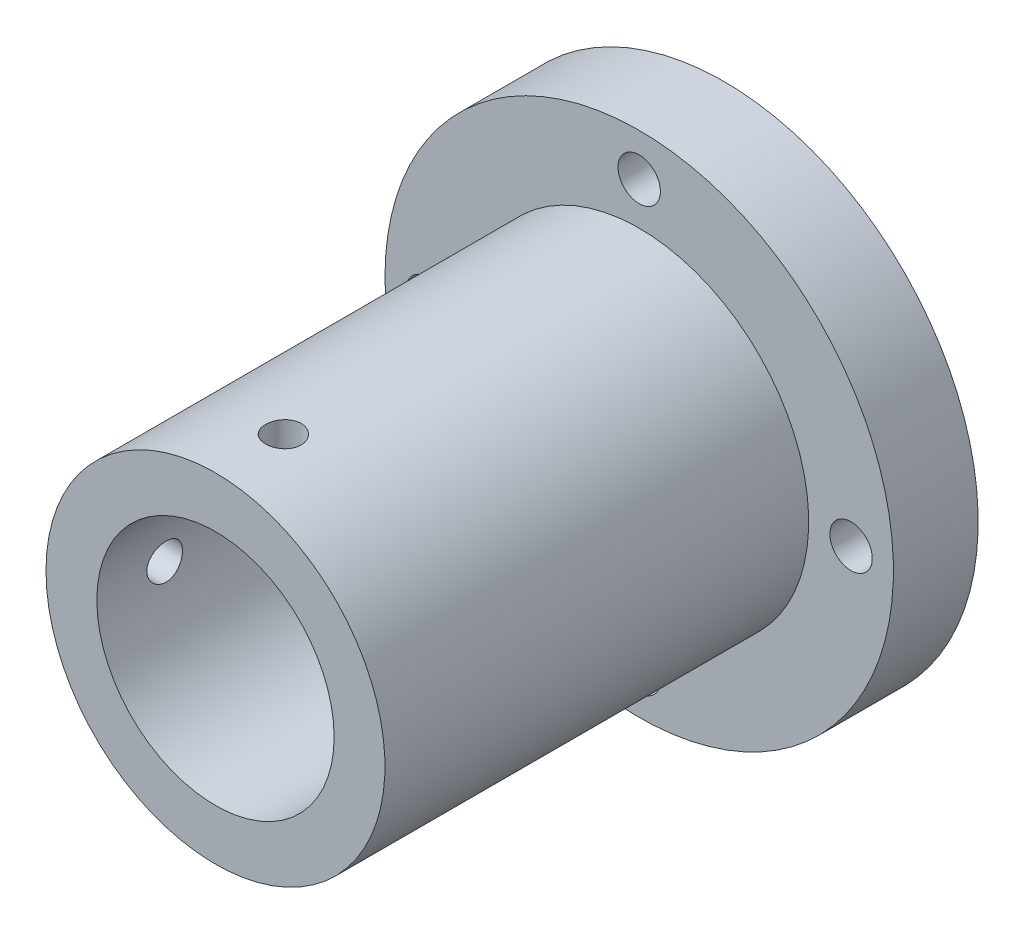
ISO-10303-21;
HEADER;
FILE_DESCRIPTION(('STEP AP214'),'2;1');
FILE_NAME('part.step','',(''),(''),'','','');
FILE_SCHEMA(('AUTOMOTIVE_DESIGN { 1 0 10303 214 1 1 1 1 }'));
ENDSEC;
DATA;
#1=APPLICATION_CONTEXT('core data for automotive mechanical design processes');
#2=APPLICATION_PROTOCOL_DEFINITION('international standard','automotive_design',2000,#1);
#3=PRODUCT_CONTEXT('',#1,'mechanical');
#4=PRODUCT('Part','Part','',(#3));
#5=PRODUCT_RELATED_PRODUCT_CATEGORY('part','',(#4));
#6=PRODUCT_DEFINITION_FORMATION('','',#4);
#7=PRODUCT_DEFINITION_CONTEXT('part definition',#1,'design');
#8=PRODUCT_DEFINITION('design','',#6,#7);
#9=PRODUCT_DEFINITION_SHAPE('','',#8);
#10=(LENGTH_UNIT() NAMED_UNIT(*) SI_UNIT(.MILLI.,.METRE.));
#11=(NAMED_UNIT(*) PLANE_ANGLE_UNIT() SI_UNIT($,.RADIAN.));
#12=(NAMED_UNIT(*) SI_UNIT($,.STERADIAN.) SOLID_ANGLE_UNIT());
#13=UNCERTAINTY_MEASURE_WITH_UNIT(LENGTH_MEASURE(1.E-05),#10,'distance_accuracy_value','');
#14=(GEOMETRIC_REPRESENTATION_CONTEXT(3) GLOBAL_UNCERTAINTY_ASSIGNED_CONTEXT((#13)) GLOBAL_UNIT_ASSIGNED_CONTEXT((#10,
#11,#12)) REPRESENTATION_CONTEXT('',''));
#15=CARTESIAN_POINT('',(0.,0.,0.));
#16=DIRECTION('',(0.,0.,1.));
#17=DIRECTION('',(1.,0.,0.));
#18=AXIS2_PLACEMENT_3D('',#15,#16,#17);
#19=CARTESIAN_POINT('',(0.,0.,5.));
#20=DIRECTION('',(0.,0.,1.));
#21=DIRECTION('',(1.,0.,0.));
#22=AXIS2_PLACEMENT_3D('',#19,#20,#21);
#23=PLANE('',#22);
#24=CARTESIAN_POINT('',(0.,0.,5.));
#25=DIRECTION('',(0.,0.,-1.));
#26=DIRECTION('',(-1.,0.,0.));
#27=AXIS2_PLACEMENT_3D('',#24,#25,#26);
#28=CIRCLE('',#27,14.);
#29=CARTESIAN_POINT('',(-14.,0.,5.));
#30=VERTEX_POINT('',#29);
#31=EDGE_CURVE('E17',#30,#30,#28,.F.);
#32=ORIENTED_EDGE('',*,*,#31,.T.);
#33=EDGE_LOOP('',(#32));
#34=FACE_BOUND('',#33,.T.);
#35=ADVANCED_FACE('F14',(#34),#23,.T.);
#36=CARTESIAN_POINT('',(0.,0.,-5.));
#37=DIRECTION('',(0.,0.,1.));
#38=DIRECTION('',(1.,0.,0.));
#39=AXIS2_PLACEMENT_3D('',#36,#37,#38);
#40=PLANE('',#39);
#41=CARTESIAN_POINT('',(-25.,0.,-5.));
#42=DIRECTION('',(0.,0.,-1.));
#43=DIRECTION('',(-1.,0.,0.));
#44=AXIS2_PLACEMENT_3D('',#41,#42,#43);
#45=CIRCLE('',#44,2.5);
#46=CARTESIAN_POINT('',(-27.5,0.,-5.));
#47=VERTEX_POINT('',#46);
#48=EDGE_CURVE('E70',#47,#47,#45,.F.);
#49=ORIENTED_EDGE('',*,*,#48,.T.);
#50=EDGE_LOOP('',(#49));
#51=FACE_BOUND('',#50,.T.);
#52=CARTESIAN_POINT('',(0.,-25.,-5.));
#53=DIRECTION('',(0.,0.,-1.));
#54=DIRECTION('',(-1.,0.,0.));
#55=AXIS2_PLACEMENT_3D('',#52,#53,#54);
#56=CIRCLE('',#55,2.5);
#57=CARTESIAN_POINT('',(-2.5,-25.,-5.));
#58=VERTEX_POINT('',#57);
#59=EDGE_CURVE('E115',#58,#58,#56,.F.);
#60=ORIENTED_EDGE('',*,*,#59,.T.);
#61=EDGE_LOOP('',(#60));
#62=FACE_BOUND('',#61,.T.);
#63=CARTESIAN_POINT('',(25.,0.,-5.));
#64=DIRECTION('',(0.,0.,-1.));
#65=DIRECTION('',(-1.,0.,0.));
#66=AXIS2_PLACEMENT_3D('',#63,#64,#65);
#67=CIRCLE('',#66,2.5);
#68=CARTESIAN_POINT('',(22.5,0.,-5.));
#69=VERTEX_POINT('',#68);
#70=EDGE_CURVE('E117',#69,#69,#67,.F.);
#71=ORIENTED_EDGE('',*,*,#70,.T.);
#72=EDGE_LOOP('',(#71));
#73=FACE_BOUND('',#72,.T.);
#74=CARTESIAN_POINT('',(0.,25.,-5.));
#75=DIRECTION('',(0.,0.,-1.));
#76=DIRECTION('',(-1.,0.,0.));
#77=AXIS2_PLACEMENT_3D('',#74,#75,#76);
#78=CIRCLE('',#77,2.5);
#79=CARTESIAN_POINT('',(-2.5,25.,-5.));
#80=VERTEX_POINT('',#79);
#81=EDGE_CURVE('E121',#80,#80,#78,.F.);
#82=ORIENTED_EDGE('',*,*,#81,.T.);
#83=EDGE_LOOP('',(#82));
#84=FACE_BOUND('',#83,.T.);
#85=CARTESIAN_POINT('',(0.,0.,-5.));
#86=DIRECTION('',(0.,0.,-1.));
#87=DIRECTION('',(-1.,0.,0.));
#88=AXIS2_PLACEMENT_3D('',#85,#86,#87);
#89=CIRCLE('',#88,30.);
#90=CARTESIAN_POINT('',(-30.,0.,-5.));
#91=VERTEX_POINT('',#90);
#92=EDGE_CURVE('E125',#91,#91,#89,.F.);
#93=ORIENTED_EDGE('',*,*,#92,.F.);
#94=EDGE_LOOP('',(#93));
#95=FACE_BOUND('',#94,.T.);
#96=ADVANCED_FACE('F78',(#51,#62,#73,#84,#95),#40,.F.);
#97=CARTESIAN_POINT('',(0.,0.,55.));
#98=DIRECTION('',(0.,0.,-1.));
#99=DIRECTION('',(-1.,0.,0.));
#100=AXIS2_PLACEMENT_3D('',#97,#98,#99);
#101=CYLINDRICAL_SURFACE('',#100,14.);
#102=CARTESIAN_POINT('',(-14.,0.,44.9));
#103=CARTESIAN_POINT('',(-13.9999980089787,-0.11714068290046,44.9000052949577));
#104=CARTESIAN_POINT('',(-13.9985131616946,-0.234432554313635,44.9098425976985));
#105=CARTESIAN_POINT('',(-13.9927290793554,-0.465823124922979,44.9489447616134));
#106=CARTESIAN_POINT('',(-13.9884240714138,-0.579914772594624,44.9782494744335));
#107=CARTESIAN_POINT('',(-13.9774834003008,-0.801395946791563,45.0553944225217));
#108=CARTESIAN_POINT('',(-13.9708504627315,-0.908793138939144,45.1032129880034));
#109=CARTESIAN_POINT('',(-13.9559885864224,-1.11399224510414,45.2159801319584));
#110=CARTESIAN_POINT('',(-13.9477602723685,-1.21179789229067,45.2809220091949));
#111=CARTESIAN_POINT('',(-13.9305486145,-1.39586278721887,45.4266462988982));
#112=CARTESIAN_POINT('',(-13.9215603333009,-1.48203529813868,45.5075377058939));
#113=CARTESIAN_POINT('',(-13.903880099461,-1.63964129329159,45.6826339614772));
#114=CARTESIAN_POINT('',(-13.8951881790357,-1.7110731794042,45.7768402517484));
#115=CARTESIAN_POINT('',(-13.8790382487596,-1.83749647372575,45.9764613403998));
#116=CARTESIAN_POINT('',(-13.8715865026312,-1.89240549328898,46.0819288677118));
#117=CARTESIAN_POINT('',(-13.8588269118523,-1.98369717270832,46.3007189372171));
#118=CARTESIAN_POINT('',(-13.8535189317151,-2.02008100340123,46.4140409824715));
#119=CARTESIAN_POINT('',(-13.8456955904233,-2.07302475948877,46.6444251605589));
#120=CARTESIAN_POINT('',(-13.8431596246646,-2.08973102294381,46.7614529514826));
#121=CARTESIAN_POINT('',(-13.8411048848352,-2.10329874143227,46.9966764318114));
#122=CARTESIAN_POINT('',(-13.8415859426359,-2.10016130228897,47.1148720557706));
#123=CARTESIAN_POINT('',(-13.8454920486523,-2.07425032244071,47.3480410205427));
#124=CARTESIAN_POINT('',(-13.8488926337376,-2.05163994330079,47.4630329616185));
#125=CARTESIAN_POINT('',(-13.8582164634308,-1.98767998650566,47.6875731850522));
#126=CARTESIAN_POINT('',(-13.8641398007478,-1.94632972017111,47.7971212671874));
#127=CARTESIAN_POINT('',(-13.8778689694365,-1.84589249546703,48.008162889936));
#128=CARTESIAN_POINT('',(-13.885682173365,-1.7867358461108,48.1096227643327));
#129=CARTESIAN_POINT('',(-13.9023046022562,-1.65241971553671,48.3012295792933));
#130=CARTESIAN_POINT('',(-13.9111138141088,-1.57726044494175,48.3913766687286));
#131=CARTESIAN_POINT('',(-13.928842633905,-1.41219190309235,48.5587379020603));
#132=CARTESIAN_POINT('',(-13.9377624766459,-1.32214507728795,48.6358163985924));
#133=CARTESIAN_POINT('',(-13.9546314946434,-1.13027383766345,48.7738230933106));
#134=CARTESIAN_POINT('',(-13.9625802305765,-1.02844413359441,48.8347439963716));
#135=CARTESIAN_POINT('',(-13.9766204724004,-0.815753279214099,48.9387074681598));
#136=CARTESIAN_POINT('',(-13.9827093630814,-0.704879686752521,48.9817248925358));
#137=CARTESIAN_POINT('',(-13.9923140680542,-0.477517996909949,49.0484036269948));
#138=CARTESIAN_POINT('',(-13.9958353148451,-0.361042312397396,49.0721058159094));
#139=CARTESIAN_POINT('',(-13.9985854781466,-0.203118908978934,49.0905516300589));
#140=CARTESIAN_POINT('',(-13.9991148171203,-0.162582918286002,49.0940919919781));
#141=CARTESIAN_POINT('',(-13.9998224239945,-0.0813707005441796,49.0988170974084));
#142=CARTESIAN_POINT('',(-14.0000006916774,-0.0406944734083723,49.1000018394593));
#143=CARTESIAN_POINT('',(-13.9999980089787,0.117140682900444,49.0999947050423));
#144=CARTESIAN_POINT('',(-13.9985131616946,0.234432554313618,49.0901574023015));
#145=CARTESIAN_POINT('',(-13.9927290793554,0.465823124922963,49.0510552383866));
#146=CARTESIAN_POINT('',(-13.9884240714138,0.579914772594608,49.0217505255665));
#147=CARTESIAN_POINT('',(-13.9774834003008,0.80139594679155,48.9446055774783));
#148=CARTESIAN_POINT('',(-13.9708504627315,0.908793138939133,48.8967870119966));
#149=CARTESIAN_POINT('',(-13.9559885864224,1.11399224510413,48.7840198680416));
#150=CARTESIAN_POINT('',(-13.9477602723685,1.21179789229066,48.7190779908051));
#151=CARTESIAN_POINT('',(-13.9305486145,1.39586278721886,48.5733537011018));
#152=CARTESIAN_POINT('',(-13.9215603333009,1.48203529813867,48.4924622941061));
#153=CARTESIAN_POINT('',(-13.903880099461,1.63964129329158,48.3173660385228));
#154=CARTESIAN_POINT('',(-13.8951881790357,1.71107317940419,48.2231597482516));
#155=CARTESIAN_POINT('',(-13.8790382487596,1.83749647372574,48.0235386596002));
#156=CARTESIAN_POINT('',(-13.8715865026312,1.89240549328898,47.9180711322883));
#157=CARTESIAN_POINT('',(-13.8588269118523,1.98369717270831,47.6992810627829));
#158=CARTESIAN_POINT('',(-13.8535189317151,2.02008100340122,47.5859590175285));
#159=CARTESIAN_POINT('',(-13.8456955904233,2.07302475948877,47.3555748394411));
#160=CARTESIAN_POINT('',(-13.8431596246646,2.08973102294381,47.2385470485175));
#161=CARTESIAN_POINT('',(-13.8411048848352,2.10329874143227,47.0033235681886));
#162=CARTESIAN_POINT('',(-13.8415859426359,2.10016130228897,46.8851279442294));
#163=CARTESIAN_POINT('',(-13.8454920486523,2.07425032244071,46.6519589794574));
#164=CARTESIAN_POINT('',(-13.8488926337376,2.05163994330079,46.5369670383815));
#165=CARTESIAN_POINT('',(-13.8582164634308,1.98767998650567,46.3124268149478));
#166=CARTESIAN_POINT('',(-13.8641398007478,1.94632972017112,46.2028787328126));
#167=CARTESIAN_POINT('',(-13.8778689694365,1.84589249546704,45.991837110064));
#168=CARTESIAN_POINT('',(-13.885682173365,1.78673584611081,45.8903772356673));
#169=CARTESIAN_POINT('',(-13.9023046022562,1.65241971553672,45.6987704207067));
#170=CARTESIAN_POINT('',(-13.9111138141088,1.57726044494176,45.6086233312714));
#171=CARTESIAN_POINT('',(-13.928842633905,1.41219190309236,45.4412620979398));
#172=CARTESIAN_POINT('',(-13.9377624766459,1.32214507728797,45.3641836014077));
#173=CARTESIAN_POINT('',(-13.9546314946434,1.13027383766346,45.2261769066894));
#174=CARTESIAN_POINT('',(-13.9625802305765,1.02844413359443,45.1652560036284));
#175=CARTESIAN_POINT('',(-13.9766204724004,0.815753279214116,45.0612925318403));
#176=CARTESIAN_POINT('',(-13.9827093630814,0.704879686752538,45.0182751074642));
#177=CARTESIAN_POINT('',(-13.9923140680542,0.477517996909965,44.9515963730052));
#178=CARTESIAN_POINT('',(-13.9958353148451,0.36104231239741,44.9278941840906));
#179=CARTESIAN_POINT('',(-13.9985854781466,0.203118908978943,44.9094483699411));
#180=CARTESIAN_POINT('',(-13.9991148171203,0.162582918286006,44.9059080080219));
#181=CARTESIAN_POINT('',(-13.9998224239945,0.0813707005441739,44.9011829025916));
#182=CARTESIAN_POINT('',(-14.0000006916774,0.0406944734083618,44.8999981605407));
#183=CARTESIAN_POINT('',(-14.,0.,44.9));
#184=B_SPLINE_CURVE_WITH_KNOTS('',3,(#102,#103,#104,#105,#106,#107,#108,#109,#110,#111,#112,
#113,#114,#115,#116,#117,#118,#119,#120,#121,#122,#123,#124,#125,#126,#127,#128,#129,#130,#131,
#132,#133,#134,#135,#136,#137,#138,#139,#140,#141,#142,#143,#144,#145,#146,#147,#148,#149,#150,
#151,#152,#153,#154,#155,#156,#157,#158,#159,#160,#161,#162,#163,#164,#165,#166,#167,#168,#169,
#170,#171,#172,#173,#174,#175,#176,#177,#178,#179,#180,#181,#182,#183),.UNSPECIFIED.,.T.,.F.,(4,
2,2,2,2,2,2,2,2,2,2,2,2,2,2,2,2,2,2,2,2,2,2,2,2,2,2,2,2,2,2,2,2,2,2,2,2,2,2,2,4),(0.,
0.351266823688869,0.703254949111487,1.05483232478804,1.40627231376208,1.76020282599753,
2.11417168984904,2.469877380567,2.82556058703228,3.17858160540013,3.53158295125868,
3.8816549994281,4.23173991357371,4.58321321765074,4.93468189600086,5.28960086702804,
5.64467981160442,6.00025577380755,6.35507722496767,6.47710664464262,6.59913613996315,
6.95040296365201,7.30239108907463,7.65396846475119,8.00540845372523,8.35933896596067,
8.71330782981218,9.06901352053015,9.42469672699542,9.77771774536328,10.1307190912218,
10.4807911393912,10.8308760535368,11.1823493576139,11.533818035964,11.8887370069912,
12.2438159515676,12.5993919137707,12.9542133649308,13.0762427846058,13.1982722799263),.UNSPECIFIED.);
#185=CARTESIAN_POINT('',(-14.,0.,44.9));
#186=VERTEX_POINT('',#185);
#187=EDGE_CURVE('E82',#186,#186,#184,.T.);
#188=ORIENTED_EDGE('',*,*,#187,.T.);
#189=EDGE_LOOP('',(#188));
#190=FACE_BOUND('',#189,.T.);
#191=ORIENTED_EDGE('',*,*,#31,.F.);
#192=EDGE_LOOP('',(#191));
#193=FACE_BOUND('',#192,.T.);
#194=CARTESIAN_POINT('',(0.,0.,55.));
#195=DIRECTION('',(0.,0.,-1.));
#196=DIRECTION('',(-1.,0.,0.));
#197=AXIS2_PLACEMENT_3D('',#194,#195,#196);
#198=CIRCLE('',#197,14.);
#199=CARTESIAN_POINT('',(-14.,0.,55.));
#200=VERTEX_POINT('',#199);
#201=EDGE_CURVE('E69',#200,#200,#198,.T.);
#202=ORIENTED_EDGE('',*,*,#201,.F.);
#203=EDGE_LOOP('',(#202));
#204=FACE_BOUND('',#203,.T.);
#205=CARTESIAN_POINT('',(0.,14.,49.1));
#206=CARTESIAN_POINT('',(0.117140682900458,13.9999980089787,49.0999947050423));
#207=CARTESIAN_POINT('',(0.234432554313634,13.9985131616946,49.0901574023015));
#208=CARTESIAN_POINT('',(0.465823124922978,13.9927290793554,49.0510552383866));
#209=CARTESIAN_POINT('',(0.579914772594622,13.9884240714138,49.0217505255665));
#210=CARTESIAN_POINT('',(0.801395946791563,13.9774834003008,48.9446055774783));
#211=CARTESIAN_POINT('',(0.908793138939148,13.9708504627315,48.8967870119966));
#212=CARTESIAN_POINT('',(1.11399224510415,13.9559885864224,48.7840198680416));
#213=CARTESIAN_POINT('',(1.21179789229067,13.9477602723685,48.7190779908051));
#214=CARTESIAN_POINT('',(1.39586278721887,13.9305486145,48.5733537011018));
#215=CARTESIAN_POINT('',(1.48203529813868,13.9215603333009,48.4924622941061));
#216=CARTESIAN_POINT('',(1.63964129329159,13.903880099461,48.3173660385228));
#217=CARTESIAN_POINT('',(1.7110731794042,13.8951881790357,48.2231597482516));
#218=CARTESIAN_POINT('',(1.83749647372575,13.8790382487596,48.0235386596002));
#219=CARTESIAN_POINT('',(1.89240549328899,13.8715865026312,47.9180711322882));
#220=CARTESIAN_POINT('',(1.98369717270832,13.8588269118523,47.6992810627829));
#221=CARTESIAN_POINT('',(2.02008100340123,13.8535189317151,47.5859590175285));
#222=CARTESIAN_POINT('',(2.07302475948877,13.8456955904233,47.3555748394411));
#223=CARTESIAN_POINT('',(2.08973102294381,13.8431596246646,47.2385470485174));
#224=CARTESIAN_POINT('',(2.10329874143227,13.8411048848352,47.0033235681886));
#225=CARTESIAN_POINT('',(2.10016130228897,13.8415859426359,46.8851279442294));
#226=CARTESIAN_POINT('',(2.07425032244071,13.8454920486523,46.6519589794573));
#227=CARTESIAN_POINT('',(2.05163994330079,13.8488926337376,46.5369670383815));
#228=CARTESIAN_POINT('',(1.98767998650566,13.8582164634308,46.3124268149478));
#229=CARTESIAN_POINT('',(1.94632972017111,13.8641398007478,46.2028787328126));
#230=CARTESIAN_POINT('',(1.84589249546703,13.8778689694365,45.991837110064));
#231=CARTESIAN_POINT('',(1.78673584611081,13.885682173365,45.8903772356673));
#232=CARTESIAN_POINT('',(1.65241971553671,13.9023046022562,45.6987704207067));
#233=CARTESIAN_POINT('',(1.57726044494176,13.9111138141088,45.6086233312714));
#234=CARTESIAN_POINT('',(1.41219190309235,13.928842633905,45.4412620979398));
#235=CARTESIAN_POINT('',(1.32214507728796,13.9377624766459,45.3641836014076));
#236=CARTESIAN_POINT('',(1.13027383766346,13.9546314946434,45.2261769066894));
#237=CARTESIAN_POINT('',(1.02844413359442,13.9625802305765,45.1652560036284));
#238=CARTESIAN_POINT('',(0.815753279214103,13.9766204724004,45.0612925318403));
#239=CARTESIAN_POINT('',(0.704879686752525,13.9827093630814,45.0182751074642));
#240=CARTESIAN_POINT('',(0.477517996909952,13.9923140680542,44.9515963730052));
#241=CARTESIAN_POINT('',(0.361042312397397,13.9958353148451,44.9278941840906));
#242=CARTESIAN_POINT('',(0.203118908978932,13.9985854781466,44.9094483699411));
#243=CARTESIAN_POINT('',(0.162582918285998,13.9991148171203,44.9059080080219));
#244=CARTESIAN_POINT('',(0.0813707005441706,13.9998224239945,44.9011829025916));
#245=CARTESIAN_POINT('',(0.0406944734083609,14.0000006916774,44.8999981605407));
#246=CARTESIAN_POINT('',(-0.117140682900458,13.9999980089787,44.9000052949577));
#247=CARTESIAN_POINT('',(-0.234432554313633,13.9985131616946,44.9098425976985));
#248=CARTESIAN_POINT('',(-0.465823124922977,13.9927290793554,44.9489447616134));
#249=CARTESIAN_POINT('',(-0.579914772594622,13.9884240714138,44.9782494744335));
#250=CARTESIAN_POINT('',(-0.801395946791564,13.9774834003008,45.0553944225217));
#251=CARTESIAN_POINT('',(-0.908793138939148,13.9708504627315,45.1032129880034));
#252=CARTESIAN_POINT('',(-1.11399224510415,13.9559885864224,45.2159801319584));
#253=CARTESIAN_POINT('',(-1.21179789229067,13.9477602723685,45.2809220091949));
#254=CARTESIAN_POINT('',(-1.39586278721887,13.9305486145,45.4266462988982));
#255=CARTESIAN_POINT('',(-1.48203529813868,13.9215603333009,45.5075377058939));
#256=CARTESIAN_POINT('',(-1.63964129329159,13.903880099461,45.6826339614772));
#257=CARTESIAN_POINT('',(-1.7110731794042,13.8951881790357,45.7768402517484));
#258=CARTESIAN_POINT('',(-1.83749647372575,13.8790382487596,45.9764613403998));
#259=CARTESIAN_POINT('',(-1.89240549328899,13.8715865026312,46.0819288677118));
#260=CARTESIAN_POINT('',(-1.98369717270832,13.8588269118523,46.3007189372171));
#261=CARTESIAN_POINT('',(-2.02008100340123,13.8535189317151,46.4140409824715));
#262=CARTESIAN_POINT('',(-2.07302475948877,13.8456955904233,46.6444251605589));
#263=CARTESIAN_POINT('',(-2.08973102294382,13.8431596246646,46.7614529514826));
#264=CARTESIAN_POINT('',(-2.10329874143227,13.8411048848352,46.9966764318114));
#265=CARTESIAN_POINT('',(-2.10016130228897,13.8415859426359,47.1148720557706));
#266=CARTESIAN_POINT('',(-2.07425032244071,13.8454920486523,47.3480410205427));
#267=CARTESIAN_POINT('',(-2.05163994330079,13.8488926337376,47.4630329616185));
#268=CARTESIAN_POINT('',(-1.98767998650566,13.8582164634308,47.6875731850522));
#269=CARTESIAN_POINT('',(-1.94632972017111,13.8641398007478,47.7971212671874));
#270=CARTESIAN_POINT('',(-1.84589249546703,13.8778689694365,48.008162889936));
#271=CARTESIAN_POINT('',(-1.78673584611081,13.885682173365,48.1096227643327));
#272=CARTESIAN_POINT('',(-1.65241971553671,13.9023046022562,48.3012295792933));
#273=CARTESIAN_POINT('',(-1.57726044494176,13.9111138141088,48.3913766687286));
#274=CARTESIAN_POINT('',(-1.41219190309235,13.928842633905,48.5587379020602));
#275=CARTESIAN_POINT('',(-1.32214507728796,13.9377624766459,48.6358163985924));
#276=CARTESIAN_POINT('',(-1.13027383766345,13.9546314946434,48.7738230933106));
#277=CARTESIAN_POINT('',(-1.02844413359442,13.9625802305765,48.8347439963716));
#278=CARTESIAN_POINT('',(-0.815753279214103,13.9766204724004,48.9387074681597));
#279=CARTESIAN_POINT('',(-0.704879686752526,13.9827093630814,48.9817248925358));
#280=CARTESIAN_POINT('',(-0.477517996909952,13.9923140680542,49.0484036269948));
#281=CARTESIAN_POINT('',(-0.361042312397397,13.9958353148451,49.0721058159094));
#282=CARTESIAN_POINT('',(-0.203118908978932,13.9985854781466,49.0905516300589));
#283=CARTESIAN_POINT('',(-0.162582918285998,13.9991148171203,49.0940919919781));
#284=CARTESIAN_POINT('',(-0.0813707005441705,13.9998224239945,49.0988170974084));
#285=CARTESIAN_POINT('',(-0.0406944734083608,14.0000006916774,49.1000018394593));
#286=CARTESIAN_POINT('',(0.,14.,49.1));
#287=B_SPLINE_CURVE_WITH_KNOTS('',3,(#205,#206,#207,#208,#209,#210,#211,#212,#213,#214,#215,
#216,#217,#218,#219,#220,#221,#222,#223,#224,#225,#226,#227,#228,#229,#230,#231,#232,#233,#234,
#235,#236,#237,#238,#239,#240,#241,#242,#243,#244,#245,#246,#247,#248,#249,#250,#251,#252,#253,
#254,#255,#256,#257,#258,#259,#260,#261,#262,#263,#264,#265,#266,#267,#268,#269,#270,#271,#272,
#273,#274,#275,#276,#277,#278,#279,#280,#281,#282,#283,#284,#285,#286),.UNSPECIFIED.,.T.,.F.,(4,
2,2,2,2,2,2,2,2,2,2,2,2,2,2,2,2,2,2,2,2,2,2,2,2,2,2,2,2,2,2,2,2,2,2,2,2,2,2,2,4),(0.,
0.351266823688869,0.703254949111487,1.05483232478804,1.40627231376209,1.76020282599753,
2.11417168984904,2.46987738056701,2.82556058703228,3.17858160540014,3.53158295125869,
3.8816549994281,4.2317399135737,4.58321321765073,4.93468189600085,5.28960086702803,
5.64467981160441,6.00025577380755,6.35507722496767,6.47710664464262,6.59913613996316,
6.95040296365203,7.30239108907465,7.6539684647512,8.00540845372525,8.35933896596069,
8.7133078298122,9.06901352053017,9.42469672699544,9.77771774536331,10.1307190912218,
10.4807911393913,10.8308760535369,11.1823493576139,11.533818035964,11.8887370069912,
12.2438159515676,12.5993919137707,12.9542133649308,13.0762427846058,13.1982722799263),.UNSPECIFIED.);
#288=CARTESIAN_POINT('',(0.,14.,49.1));
#289=VERTEX_POINT('',#288);
#290=EDGE_CURVE('E62',#289,#289,#287,.T.);
#291=ORIENTED_EDGE('',*,*,#290,.T.);
#292=EDGE_LOOP('',(#291));
#293=FACE_BOUND('',#292,.T.);
#294=ADVANCED_FACE('F73',(#190,#193,#204,#293),#101,.F.);
#295=CARTESIAN_POINT('',(0.,0.,5.));
#296=DIRECTION('',(0.,0.,-1.));
#297=DIRECTION('',(-1.,0.,0.));
#298=AXIS2_PLACEMENT_3D('',#295,#296,#297);
#299=CYLINDRICAL_SURFACE('',#298,30.);
#300=ORIENTED_EDGE('',*,*,#92,.T.);
#301=EDGE_LOOP('',(#300));
#302=FACE_BOUND('',#301,.T.);
#303=CARTESIAN_POINT('',(0.,0.,5.));
#304=DIRECTION('',(0.,0.,-1.));
#305=DIRECTION('',(-1.,0.,0.));
#306=AXIS2_PLACEMENT_3D('',#303,#304,#305);
#307=CIRCLE('',#306,30.);
#308=CARTESIAN_POINT('',(-30.,0.,5.));
#309=VERTEX_POINT('',#308);
#310=EDGE_CURVE('E87',#309,#309,#307,.F.);
#311=ORIENTED_EDGE('',*,*,#310,.F.);
#312=EDGE_LOOP('',(#311));
#313=FACE_BOUND('',#312,.T.);
#314=ADVANCED_FACE('F77',(#302,#313),#299,.T.);
#315=CARTESIAN_POINT('',(0.,25.,-5.));
#316=DIRECTION('',(0.,0.,-1.));
#317=DIRECTION('',(-1.,0.,0.));
#318=AXIS2_PLACEMENT_3D('',#315,#316,#317);
#319=CYLINDRICAL_SURFACE('',#318,2.5);
#320=ORIENTED_EDGE('',*,*,#81,.F.);
#321=EDGE_LOOP('',(#320));
#322=FACE_BOUND('',#321,.T.);
#323=CARTESIAN_POINT('',(0.,25.,5.));
#324=DIRECTION('',(0.,0.,-1.));
#325=DIRECTION('',(-1.,0.,0.));
#326=AXIS2_PLACEMENT_3D('',#323,#324,#325);
#327=CIRCLE('',#326,2.5);
#328=CARTESIAN_POINT('',(-2.5,25.,5.));
#329=VERTEX_POINT('',#328);
#330=EDGE_CURVE('E90',#329,#329,#327,.T.);
#331=ORIENTED_EDGE('',*,*,#330,.F.);
#332=EDGE_LOOP('',(#331));
#333=FACE_BOUND('',#332,.T.);
#334=ADVANCED_FACE('F205',(#322,#333),#319,.F.);
#335=CARTESIAN_POINT('',(25.,0.,-5.));
#336=DIRECTION('',(0.,0.,-1.));
#337=DIRECTION('',(-1.,0.,0.));
#338=AXIS2_PLACEMENT_3D('',#335,#336,#337);
#339=CYLINDRICAL_SURFACE('',#338,2.5);
#340=ORIENTED_EDGE('',*,*,#70,.F.);
#341=EDGE_LOOP('',(#340));
#342=FACE_BOUND('',#341,.T.);
#343=CARTESIAN_POINT('',(25.,0.,5.));
#344=DIRECTION('',(0.,0.,-1.));
#345=DIRECTION('',(-1.,0.,0.));
#346=AXIS2_PLACEMENT_3D('',#343,#344,#345);
#347=CIRCLE('',#346,2.5);
#348=CARTESIAN_POINT('',(22.5,0.,5.));
#349=VERTEX_POINT('',#348);
#350=EDGE_CURVE('E93',#349,#349,#347,.T.);
#351=ORIENTED_EDGE('',*,*,#350,.F.);
#352=EDGE_LOOP('',(#351));
#353=FACE_BOUND('',#352,.T.);
#354=ADVANCED_FACE('F110',(#342,#353),#339,.F.);
#355=CARTESIAN_POINT('',(0.,-25.,-5.));
#356=DIRECTION('',(0.,0.,-1.));
#357=DIRECTION('',(-1.,0.,0.));
#358=AXIS2_PLACEMENT_3D('',#355,#356,#357);
#359=CYLINDRICAL_SURFACE('',#358,2.5);
#360=ORIENTED_EDGE('',*,*,#59,.F.);
#361=EDGE_LOOP('',(#360));
#362=FACE_BOUND('',#361,.T.);
#363=CARTESIAN_POINT('',(0.,-25.,5.));
#364=DIRECTION('',(0.,0.,-1.));
#365=DIRECTION('',(-1.,0.,0.));
#366=AXIS2_PLACEMENT_3D('',#363,#364,#365);
#367=CIRCLE('',#366,2.5);
#368=CARTESIAN_POINT('',(-2.5,-25.,5.));
#369=VERTEX_POINT('',#368);
#370=EDGE_CURVE('E95',#369,#369,#367,.T.);
#371=ORIENTED_EDGE('',*,*,#370,.F.);
#372=EDGE_LOOP('',(#371));
#373=FACE_BOUND('',#372,.T.);
#374=ADVANCED_FACE('F104',(#362,#373),#359,.F.);
#375=CARTESIAN_POINT('',(-25.,0.,-5.));
#376=DIRECTION('',(0.,0.,-1.));
#377=DIRECTION('',(-1.,0.,0.));
#378=AXIS2_PLACEMENT_3D('',#375,#376,#377);
#379=CYLINDRICAL_SURFACE('',#378,2.5);
#380=ORIENTED_EDGE('',*,*,#48,.F.);
#381=EDGE_LOOP('',(#380));
#382=FACE_BOUND('',#381,.T.);
#383=CARTESIAN_POINT('',(-25.,0.,5.));
#384=DIRECTION('',(0.,0.,-1.));
#385=DIRECTION('',(-1.,0.,0.));
#386=AXIS2_PLACEMENT_3D('',#383,#384,#385);
#387=CIRCLE('',#386,2.5);
#388=CARTESIAN_POINT('',(-27.5,0.,5.));
#389=VERTEX_POINT('',#388);
#390=EDGE_CURVE('E50',#389,#389,#387,.T.);
#391=ORIENTED_EDGE('',*,*,#390,.F.);
#392=EDGE_LOOP('',(#391));
#393=FACE_BOUND('',#392,.T.);
#394=ADVANCED_FACE('F57',(#382,#393),#379,.F.);
#395=CARTESIAN_POINT('',(0.,0.,47.));
#396=DIRECTION('',(0.,-1.,0.));
#397=DIRECTION('',(0.,0.,-1.));
#398=AXIS2_PLACEMENT_3D('',#395,#396,#397);
#399=CYLINDRICAL_SURFACE('',#398,2.1);
#400=ORIENTED_EDGE('',*,*,#290,.F.);
#401=EDGE_LOOP('',(#400));
#402=FACE_BOUND('',#401,.T.);
#403=CARTESIAN_POINT('',(0.,20.,44.9));
#404=CARTESIAN_POINT('',(0.117505845996309,19.9999986301854,44.9000050834901));
#405=CARTESIAN_POINT('',(0.235167108011225,19.998952658043,44.9099033769067));
#406=CARTESIAN_POINT('',(0.467305004892584,19.9948785306546,44.9492593784143));
#407=CARTESIAN_POINT('',(0.581774434833952,19.991846218339,44.9787581087213));
#408=CARTESIAN_POINT('',(0.804015461737195,19.9841414039624,45.0564485302324));
#409=CARTESIAN_POINT('',(0.911793636954229,19.9794705438234,45.1046215137847));
#410=CARTESIAN_POINT('',(1.11768293146098,19.9690115905968,45.2182566692385));
#411=CARTESIAN_POINT('',(1.21579820729022,19.9632239810824,45.2837113623418));
#412=CARTESIAN_POINT('',(1.40002924042998,19.9511524636972,45.4303417523556));
#413=CARTESIAN_POINT('',(1.48610042496362,19.9448668404772,45.5115733201196));
#414=CARTESIAN_POINT('',(1.64341864167484,19.9325216200648,45.6873357474427));
#415=CARTESIAN_POINT('',(1.71466424971689,19.9264620446322,45.7818678831855));
#416=CARTESIAN_POINT('',(1.84045789861986,19.9152385541419,45.9818167137933));
#417=CARTESIAN_POINT('',(1.89496671332757,19.9100767552911,46.0872582160187));
#418=CARTESIAN_POINT('',(1.9854883044464,19.9012541552669,46.3058600661494));
#419=CARTESIAN_POINT('',(2.0215017433712,19.8975933003298,46.4190201374072));
#420=CARTESIAN_POINT('',(2.07388177312296,19.8922022986457,46.6494037546083));
#421=CARTESIAN_POINT('',(2.09032057514461,19.8904650573267,46.7666107137822));
#422=CARTESIAN_POINT('',(2.10330794059689,19.8890960249878,47.0021321306547));
#423=CARTESIAN_POINT('',(2.09985704207379,19.8894641770139,47.1204465583081));
#424=CARTESIAN_POINT('',(2.07322249630994,19.8922578471505,47.3543243165241));
#425=CARTESIAN_POINT('',(2.05011800082258,19.8946751126459,47.4698967735539));
#426=CARTESIAN_POINT('',(1.9849549698465,19.9012817942794,47.6955156519012));
#427=CARTESIAN_POINT('',(1.94289598328955,19.9054712525911,47.8055619416408));
#428=CARTESIAN_POINT('',(1.84092926233362,19.915159913536,48.0172563619201));
#429=CARTESIAN_POINT('',(1.78098593709443,19.9206617234034,48.1188872251712));
#430=CARTESIAN_POINT('',(1.64498296264359,19.9323524301279,48.3106676925109));
#431=CARTESIAN_POINT('',(1.56892411973582,19.9385412926024,48.4008178706488));
#432=CARTESIAN_POINT('',(1.40242305071538,19.9509447407233,48.5675312161979));
#433=CARTESIAN_POINT('',(1.31191526463758,19.9571593114111,48.6440289151933));
#434=CARTESIAN_POINT('',(1.11925847652789,19.968889757131,48.7807914070323));
#435=CARTESIAN_POINT('',(1.01710412339278,19.974405308516,48.8410486949767));
#436=CARTESIAN_POINT('',(0.803981331332801,19.9841187855564,48.943610840698));
#437=CARTESIAN_POINT('',(0.693004007948912,19.9883153614376,48.9858973235211));
#438=CARTESIAN_POINT('',(0.46562180827283,19.9949009482533,49.0511296000127));
#439=CARTESIAN_POINT('',(0.349228997392624,19.9972937906352,49.0741164014978));
#440=CARTESIAN_POINT('',(0.193380161984669,19.9991025766579,49.0914376869322));
#441=CARTESIAN_POINT('',(0.154779255038439,19.999438440425,49.0946461831563));
#442=CARTESIAN_POINT('',(0.0774578621785602,19.9998873779111,49.0989281778616));
#443=CARTESIAN_POINT('',(0.0387373762367906,20.0000004515777,49.1000016758406));
#444=CARTESIAN_POINT('',(-0.117505845996308,19.9999986301854,49.0999949165099));
#445=CARTESIAN_POINT('',(-0.235167108011224,19.998952658043,49.0900966230933));
#446=CARTESIAN_POINT('',(-0.467305004892583,19.9948785306546,49.0507406215857));
#447=CARTESIAN_POINT('',(-0.581774434833952,19.991846218339,49.0212418912787));
#448=CARTESIAN_POINT('',(-0.804015461737196,19.9841414039624,48.9435514697676));
#449=CARTESIAN_POINT('',(-0.91179363695423,19.9794705438234,48.8953784862153));
#450=CARTESIAN_POINT('',(-1.11768293146098,19.9690115905968,48.7817433307615));
#451=CARTESIAN_POINT('',(-1.21579820729022,19.9632239810824,48.7162886376582));
#452=CARTESIAN_POINT('',(-1.40002924042998,19.9511524636972,48.5696582476444));
#453=CARTESIAN_POINT('',(-1.48610042496362,19.9448668404772,48.4884266798804));
#454=CARTESIAN_POINT('',(-1.64341864167484,19.9325216200648,48.3126642525573));
#455=CARTESIAN_POINT('',(-1.71466424971689,19.9264620446322,48.2181321168145));
#456=CARTESIAN_POINT('',(-1.84045789861986,19.9152385541419,48.0181832862067));
#457=CARTESIAN_POINT('',(-1.89496671332757,19.9100767552911,47.9127417839813));
#458=CARTESIAN_POINT('',(-1.9854883044464,19.9012541552669,47.6941399338506));
#459=CARTESIAN_POINT('',(-2.0215017433712,19.8975933003298,47.5809798625928));
#460=CARTESIAN_POINT('',(-2.07388177312296,19.8922022986457,47.3505962453917));
#461=CARTESIAN_POINT('',(-2.09032057514461,19.8904650573267,47.2333892862178));
#462=CARTESIAN_POINT('',(-2.10330794059689,19.8890960249878,46.9978678693453));
#463=CARTESIAN_POINT('',(-2.09985704207379,19.8894641770139,46.8795534416919));
#464=CARTESIAN_POINT('',(-2.07322249630994,19.8922578471505,46.6456756834759));
#465=CARTESIAN_POINT('',(-2.05011800082258,19.8946751126459,46.5301032264461));
#466=CARTESIAN_POINT('',(-1.9849549698465,19.9012817942794,46.3044843480988));
#467=CARTESIAN_POINT('',(-1.94289598328955,19.9054712525911,46.1944380583592));
#468=CARTESIAN_POINT('',(-1.84092926233362,19.915159913536,45.9827436380799));
#469=CARTESIAN_POINT('',(-1.78098593709443,19.9206617234034,45.8811127748288));
#470=CARTESIAN_POINT('',(-1.64498296264359,19.9323524301279,45.6893323074891));
#471=CARTESIAN_POINT('',(-1.56892411973583,19.9385412926024,45.5991821293512));
#472=CARTESIAN_POINT('',(-1.40242305071538,19.9509447407233,45.4324687838021));
#473=CARTESIAN_POINT('',(-1.31191526463759,19.9571593114111,45.3559710848067));
#474=CARTESIAN_POINT('',(-1.11925847652789,19.968889757131,45.2192085929677));
#475=CARTESIAN_POINT('',(-1.01710412339278,19.974405308516,45.1589513050233));
#476=CARTESIAN_POINT('',(-0.803981331332799,19.9841187855564,45.056389159302));
#477=CARTESIAN_POINT('',(-0.69300400794891,19.9883153614376,45.0141026764789));
#478=CARTESIAN_POINT('',(-0.465621808272827,19.9949009482533,44.9488703999873));
#479=CARTESIAN_POINT('',(-0.349228997392621,19.9972937906352,44.9258835985022));
#480=CARTESIAN_POINT('',(-0.193380161984668,19.9991025766579,44.9085623130678));
#481=CARTESIAN_POINT('',(-0.154779255038439,19.999438440425,44.9053538168437));
#482=CARTESIAN_POINT('',(-0.0774578621785597,19.9998873779111,44.9010718221384));
#483=CARTESIAN_POINT('',(-0.0387373762367903,20.0000004515777,44.8999983241594));
#484=CARTESIAN_POINT('',(0.,20.,44.9));
#485=B_SPLINE_CURVE_WITH_KNOTS('',3,(#403,#404,#405,#406,#407,#408,#409,#410,#411,#412,#413,
#414,#415,#416,#417,#418,#419,#420,#421,#422,#423,#424,#425,#426,#427,#428,#429,#430,#431,#432,
#433,#434,#435,#436,#437,#438,#439,#440,#441,#442,#443,#444,#445,#446,#447,#448,#449,#450,#451,
#452,#453,#454,#455,#456,#457,#458,#459,#460,#461,#462,#463,#464,#465,#466,#467,#468,#469,#470,
#471,#472,#473,#474,#475,#476,#477,#478,#479,#480,#481,#482,#483,#484),.UNSPECIFIED.,.T.,.F.,(4,
2,2,2,2,2,2,2,2,2,2,2,2,2,2,2,2,2,2,2,2,2,2,2,2,2,2,2,2,2,2,2,2,2,2,2,2,2,2,2,4),(0.,
0.352369999305924,0.705479814872962,1.05823679946624,1.41084137515863,1.76471818374258,
2.11862896983352,2.47336299716932,2.82808431686686,3.18149296853005,3.5348920600032,
3.88687459448255,4.2388655056851,4.59156162468969,4.94424010149799,5.29856683330933,
5.65305702432404,6.00790881069475,6.36200468871055,6.47816815199866,6.59433164260576,
6.94670164191168,7.29981145747872,7.65256844207199,8.00517301776438,8.35904982634834,
8.71296061243928,9.06769463977509,9.42241595947261,9.77582461113581,10.129223702609,
10.4812062370883,10.8331971482909,11.1858932672954,11.5385717441037,11.8928984759151,
12.2473886669298,12.6022404533005,12.9563363313163,13.0724997946044,13.1886632852115),.UNSPECIFIED.);
#486=CARTESIAN_POINT('',(0.,20.,44.9));
#487=VERTEX_POINT('',#486);
#488=EDGE_CURVE('E44',#487,#487,#485,.T.);
#489=ORIENTED_EDGE('',*,*,#488,.F.);
#490=EDGE_LOOP('',(#489));
#491=FACE_BOUND('',#490,.T.);
#492=ADVANCED_FACE('F52',(#402,#491),#399,.F.);
#493=CARTESIAN_POINT('',(0.,0.,55.));
#494=DIRECTION('',(0.,0.,1.));
#495=DIRECTION('',(1.,0.,0.));
#496=AXIS2_PLACEMENT_3D('',#493,#494,#495);
#497=PLANE('',#496);
#498=ORIENTED_EDGE('',*,*,#201,.T.);
#499=EDGE_LOOP('',(#498));
#500=FACE_BOUND('',#499,.T.);
#501=CARTESIAN_POINT('',(0.,0.,55.));
#502=DIRECTION('',(0.,0.,-1.));
#503=DIRECTION('',(-1.,0.,0.));
#504=AXIS2_PLACEMENT_3D('',#501,#502,#503);
#505=CIRCLE('',#504,20.);
#506=CARTESIAN_POINT('',(-20.,0.,55.));
#507=VERTEX_POINT('',#506);
#508=EDGE_CURVE('E26',#507,#507,#505,.T.);
#509=ORIENTED_EDGE('',*,*,#508,.F.);
#510=EDGE_LOOP('',(#509));
#511=FACE_BOUND('',#510,.T.);
#512=ADVANCED_FACE('F56',(#500,#511),#497,.T.);
#513=CARTESIAN_POINT('',(0.,0.,47.));
#514=DIRECTION('',(1.,0.,0.));
#515=DIRECTION('',(0.,0.,-1.));
#516=AXIS2_PLACEMENT_3D('',#513,#514,#515);
#517=CYLINDRICAL_SURFACE('',#516,2.1);
#518=ORIENTED_EDGE('',*,*,#187,.F.);
#519=EDGE_LOOP('',(#518));
#520=FACE_BOUND('',#519,.T.);
#521=CARTESIAN_POINT('',(-20.,0.,49.1));
#522=CARTESIAN_POINT('',(-19.9999986301854,-0.117505845996328,49.0999949165099));
#523=CARTESIAN_POINT('',(-19.998952658043,-0.235167108011244,49.0900966230933));
#524=CARTESIAN_POINT('',(-19.9948785306546,-0.467305004892602,49.0507406215857));
#525=CARTESIAN_POINT('',(-19.991846218339,-0.581774434833969,49.0212418912787));
#526=CARTESIAN_POINT('',(-19.9841414039624,-0.804015461737212,48.9435514697676));
#527=CARTESIAN_POINT('',(-19.9794705438234,-0.911793636954246,48.8953784862153));
#528=CARTESIAN_POINT('',(-19.9690115905968,-1.11768293146099,48.7817433307615));
#529=CARTESIAN_POINT('',(-19.9632239810824,-1.21579820729024,48.7162886376582));
#530=CARTESIAN_POINT('',(-19.9511524636972,-1.40002924042999,48.5696582476443));
#531=CARTESIAN_POINT('',(-19.9448668404772,-1.48610042496363,48.4884266798804));
#532=CARTESIAN_POINT('',(-19.9325216200648,-1.64341864167485,48.3126642525572));
#533=CARTESIAN_POINT('',(-19.9264620446322,-1.7146642497169,48.2181321168145));
#534=CARTESIAN_POINT('',(-19.9152385541419,-1.84045789861986,48.0181832862067));
#535=CARTESIAN_POINT('',(-19.9100767552911,-1.89496671332758,47.9127417839813));
#536=CARTESIAN_POINT('',(-19.9012541552669,-1.9854883044464,47.6941399338506));
#537=CARTESIAN_POINT('',(-19.8975933003298,-2.02150174337121,47.5809798625927));
#538=CARTESIAN_POINT('',(-19.8922022986457,-2.07388177312296,47.3505962453917));
#539=CARTESIAN_POINT('',(-19.8904650573267,-2.09032057514462,47.2333892862178));
#540=CARTESIAN_POINT('',(-19.8890960249878,-2.10330794059689,46.9978678693453));
#541=CARTESIAN_POINT('',(-19.8894641770139,-2.09985704207379,46.8795534416919));
#542=CARTESIAN_POINT('',(-19.8922578471505,-2.07322249630994,46.6456756834759));
#543=CARTESIAN_POINT('',(-19.8946751126459,-2.05011800082257,46.530103226446));
#544=CARTESIAN_POINT('',(-19.9012817942794,-1.98495496984649,46.3044843480988));
#545=CARTESIAN_POINT('',(-19.9054712525911,-1.94289598328955,46.1944380583592));
#546=CARTESIAN_POINT('',(-19.915159913536,-1.84092926233361,45.9827436380799));
#547=CARTESIAN_POINT('',(-19.9206617234034,-1.78098593709442,45.8811127748288));
#548=CARTESIAN_POINT('',(-19.9323524301279,-1.64498296264357,45.6893323074891));
#549=CARTESIAN_POINT('',(-19.9385412926024,-1.56892411973581,45.5991821293512));
#550=CARTESIAN_POINT('',(-19.9509447407233,-1.40242305071536,45.4324687838021));
#551=CARTESIAN_POINT('',(-19.9571593114111,-1.31191526463756,45.3559710848067));
#552=CARTESIAN_POINT('',(-19.968889757131,-1.11925847652787,45.2192085929676));
#553=CARTESIAN_POINT('',(-19.974405308516,-1.01710412339276,45.1589513050233));
#554=CARTESIAN_POINT('',(-19.9841187855564,-0.803981331332783,45.056389159302));
#555=CARTESIAN_POINT('',(-19.9883153614376,-0.693004007948893,45.0141026764789));
#556=CARTESIAN_POINT('',(-19.9949009482533,-0.465621808272809,44.9488703999873));
#557=CARTESIAN_POINT('',(-19.9972937906352,-0.349228997392602,44.9258835985022));
#558=CARTESIAN_POINT('',(-19.9991025766579,-0.193380161984651,44.9085623130678));
#559=CARTESIAN_POINT('',(-19.999438440425,-0.154779255038425,44.9053538168437));
#560=CARTESIAN_POINT('',(-19.9998873779111,-0.0774578621785535,44.9010718221384));
#561=CARTESIAN_POINT('',(-20.0000004515777,-0.038737376236788,44.8999983241594));
#562=CARTESIAN_POINT('',(-19.9999986301854,0.117505845996306,44.9000050834901));
#563=CARTESIAN_POINT('',(-19.998952658043,0.235167108011222,44.9099033769067));
#564=CARTESIAN_POINT('',(-19.9948785306546,0.467305004892581,44.9492593784143));
#565=CARTESIAN_POINT('',(-19.991846218339,0.581774434833949,44.9787581087213));
#566=CARTESIAN_POINT('',(-19.9841414039624,0.804015461737195,45.0564485302324));
#567=CARTESIAN_POINT('',(-19.9794705438234,0.91179363695423,45.1046215137847));
#568=CARTESIAN_POINT('',(-19.9690115905968,1.11768293146098,45.2182566692385));
#569=CARTESIAN_POINT('',(-19.9632239810824,1.21579820729022,45.2837113623418));
#570=CARTESIAN_POINT('',(-19.9511524636972,1.40002924042998,45.4303417523556));
#571=CARTESIAN_POINT('',(-19.9448668404772,1.48610042496362,45.5115733201196));
#572=CARTESIAN_POINT('',(-19.9325216200648,1.64341864167484,45.6873357474427));
#573=CARTESIAN_POINT('',(-19.9264620446322,1.71466424971689,45.7818678831855));
#574=CARTESIAN_POINT('',(-19.9152385541419,1.84045789861986,45.9818167137933));
#575=CARTESIAN_POINT('',(-19.9100767552911,1.89496671332757,46.0872582160187));
#576=CARTESIAN_POINT('',(-19.9012541552669,1.9854883044464,46.3058600661494));
#577=CARTESIAN_POINT('',(-19.8975933003298,2.0215017433712,46.4190201374072));
#578=CARTESIAN_POINT('',(-19.8922022986457,2.07388177312296,46.6494037546083));
#579=CARTESIAN_POINT('',(-19.8904650573267,2.09032057514461,46.7666107137822));
#580=CARTESIAN_POINT('',(-19.8890960249878,2.10330794059689,47.0021321306547));
#581=CARTESIAN_POINT('',(-19.8894641770139,2.09985704207379,47.1204465583081));
#582=CARTESIAN_POINT('',(-19.8922578471505,2.07322249630994,47.3543243165241));
#583=CARTESIAN_POINT('',(-19.8946751126459,2.05011800082258,47.4698967735539));
#584=CARTESIAN_POINT('',(-19.9012817942794,1.9849549698465,47.6955156519012));
#585=CARTESIAN_POINT('',(-19.9054712525911,1.94289598328955,47.8055619416408));
#586=CARTESIAN_POINT('',(-19.915159913536,1.84092926233362,48.0172563619201));
#587=CARTESIAN_POINT('',(-19.9206617234034,1.78098593709443,48.1188872251712));
#588=CARTESIAN_POINT('',(-19.9323524301279,1.64498296264359,48.3106676925109));
#589=CARTESIAN_POINT('',(-19.9385412926024,1.56892411973583,48.4008178706488));
#590=CARTESIAN_POINT('',(-19.9509447407233,1.40242305071538,48.5675312161979));
#591=CARTESIAN_POINT('',(-19.9571593114111,1.31191526463758,48.6440289151933));
#592=CARTESIAN_POINT('',(-19.968889757131,1.11925847652789,48.7807914070323));
#593=CARTESIAN_POINT('',(-19.974405308516,1.01710412339278,48.8410486949767));
#594=CARTESIAN_POINT('',(-19.9841187855564,0.8039813313328,48.943610840698));
#595=CARTESIAN_POINT('',(-19.9883153614376,0.693004007948911,48.9858973235211));
#596=CARTESIAN_POINT('',(-19.9949009482533,0.46562180827283,49.0511296000127));
#597=CARTESIAN_POINT('',(-19.9972937906352,0.349228997392623,49.0741164014978));
#598=CARTESIAN_POINT('',(-19.9991025766579,0.193380161984666,49.0914376869322));
#599=CARTESIAN_POINT('',(-19.999438440425,0.154779255038433,49.0946461831563));
#600=CARTESIAN_POINT('',(-19.9998873779111,0.0774578621785468,49.0989281778616));
#601=CARTESIAN_POINT('',(-20.0000004515777,0.038737376236774,49.1000016758406));
#602=CARTESIAN_POINT('',(-20.,0.,49.1));
#603=B_SPLINE_CURVE_WITH_KNOTS('',3,(#521,#522,#523,#524,#525,#526,#527,#528,#529,#530,#531,
#532,#533,#534,#535,#536,#537,#538,#539,#540,#541,#542,#543,#544,#545,#546,#547,#548,#549,#550,
#551,#552,#553,#554,#555,#556,#557,#558,#559,#560,#561,#562,#563,#564,#565,#566,#567,#568,#569,
#570,#571,#572,#573,#574,#575,#576,#577,#578,#579,#580,#581,#582,#583,#584,#585,#586,#587,#588,
#589,#590,#591,#592,#593,#594,#595,#596,#597,#598,#599,#600,#601,#602),.UNSPECIFIED.,.T.,.F.,(4,
2,2,2,2,2,2,2,2,2,2,2,2,2,2,2,2,2,2,2,2,2,2,2,2,2,2,2,2,2,2,2,2,2,2,2,2,2,2,2,4),(0.,
0.352369999305923,0.705479814872962,1.05823679946623,1.41084137515863,1.76471818374258,
2.11862896983352,2.47336299716932,2.82808431686685,3.18149296853005,3.53489206000319,
3.88687459448254,4.2388655056851,4.5915616246897,4.944240101498,5.29856683330934,
5.65305702432404,6.00790881069475,6.36200468871056,6.47816815199865,6.59433164260574,
6.94670164191166,7.2998114574787,7.65256844207198,8.00517301776437,8.35904982634832,
8.71296061243926,9.06769463977506,9.4224159594726,9.7758246111358,10.1292237026089,
10.4812062370883,10.8331971482908,11.1858932672954,11.5385717441037,11.8928984759151,
12.2473886669298,12.6022404533005,12.9563363313163,13.0724997946044,13.1886632852115),.UNSPECIFIED.);
#604=CARTESIAN_POINT('',(-20.,0.,49.1));
#605=VERTEX_POINT('',#604);
#606=EDGE_CURVE('E21',#605,#605,#603,.T.);
#607=ORIENTED_EDGE('',*,*,#606,.F.);
#608=EDGE_LOOP('',(#607));
#609=FACE_BOUND('',#608,.T.);
#610=ADVANCED_FACE('F34',(#520,#609),#517,.F.);
#611=CARTESIAN_POINT('',(0.,0.,5.));
#612=DIRECTION('',(0.,0.,1.));
#613=DIRECTION('',(1.,0.,0.));
#614=AXIS2_PLACEMENT_3D('',#611,#612,#613);
#615=PLANE('',#614);
#616=CARTESIAN_POINT('',(0.,0.,5.));
#617=DIRECTION('',(0.,0.,-1.));
#618=DIRECTION('',(-1.,0.,0.));
#619=AXIS2_PLACEMENT_3D('',#616,#617,#618);
#620=CIRCLE('',#619,20.);
#621=CARTESIAN_POINT('',(-20.,0.,5.));
#622=VERTEX_POINT('',#621);
#623=EDGE_CURVE('E10',#622,#622,#620,.F.);
#624=ORIENTED_EDGE('',*,*,#623,.F.);
#625=EDGE_LOOP('',(#624));
#626=FACE_BOUND('',#625,.T.);
#627=ORIENTED_EDGE('',*,*,#390,.T.);
#628=EDGE_LOOP('',(#627));
#629=FACE_BOUND('',#628,.T.);
#630=ORIENTED_EDGE('',*,*,#370,.T.);
#631=EDGE_LOOP('',(#630));
#632=FACE_BOUND('',#631,.T.);
#633=ORIENTED_EDGE('',*,*,#350,.T.);
#634=EDGE_LOOP('',(#633));
#635=FACE_BOUND('',#634,.T.);
#636=ORIENTED_EDGE('',*,*,#330,.T.);
#637=EDGE_LOOP('',(#636));
#638=FACE_BOUND('',#637,.T.);
#639=ORIENTED_EDGE('',*,*,#310,.T.);
#640=EDGE_LOOP('',(#639));
#641=FACE_BOUND('',#640,.T.);
#642=ADVANCED_FACE('F41',(#626,#629,#632,#635,#638,#641),#615,.T.);
#643=CARTESIAN_POINT('',(0.,0.,55.));
#644=DIRECTION('',(0.,0.,-1.));
#645=DIRECTION('',(-1.,0.,0.));
#646=AXIS2_PLACEMENT_3D('',#643,#644,#645);
#647=CYLINDRICAL_SURFACE('',#646,20.);
#648=ORIENTED_EDGE('',*,*,#606,.T.);
#649=EDGE_LOOP('',(#648));
#650=FACE_BOUND('',#649,.T.);
#651=ORIENTED_EDGE('',*,*,#623,.T.);
#652=EDGE_LOOP('',(#651));
#653=FACE_BOUND('',#652,.T.);
#654=ORIENTED_EDGE('',*,*,#508,.T.);
#655=EDGE_LOOP('',(#654));
#656=FACE_BOUND('',#655,.T.);
#657=ORIENTED_EDGE('',*,*,#488,.T.);
#658=EDGE_LOOP('',(#657));
#659=FACE_BOUND('',#658,.T.);
#660=ADVANCED_FACE('F38',(#650,#653,#656,#659),#647,.T.);
#661=CLOSED_SHELL('',(#35,#96,#294,#314,#334,#354,#374,#394,#492,#512,#610,#642,#660));
#662=MANIFOLD_SOLID_BREP('B1',#661);
#663=ADVANCED_BREP_SHAPE_REPRESENTATION('',(#18,#662),#14);
#664=SHAPE_DEFINITION_REPRESENTATION(#9,#663);
ENDSEC;
END-ISO-10303-21;
